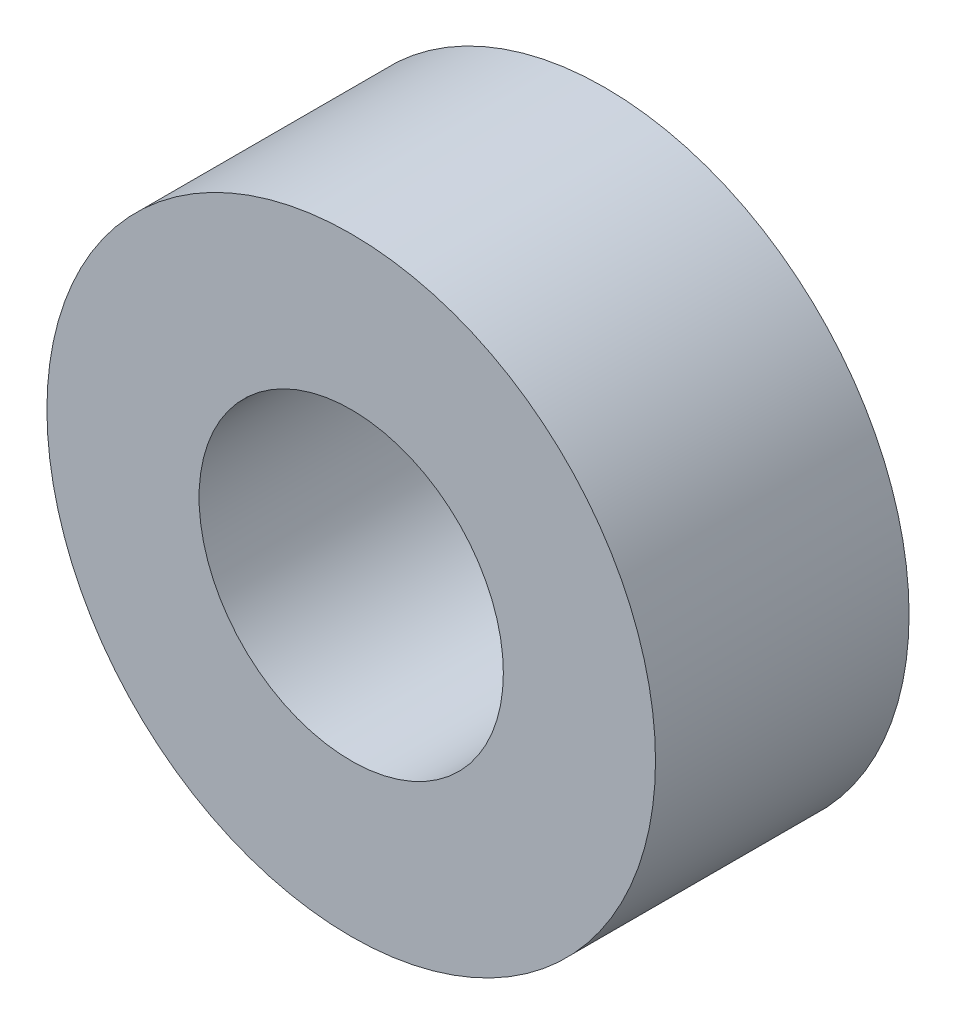
ISO-10303-21;
HEADER;
FILE_DESCRIPTION(('STEP AP214'),'2;1');
FILE_NAME('part.step','',(''),(''),'','','');
FILE_SCHEMA(('AUTOMOTIVE_DESIGN { 1 0 10303 214 1 1 1 1 }'));
ENDSEC;
DATA;
#1=APPLICATION_CONTEXT('core data for automotive mechanical design processes');
#2=APPLICATION_PROTOCOL_DEFINITION('international standard','automotive_design',2000,#1);
#3=PRODUCT_CONTEXT('',#1,'mechanical');
#4=PRODUCT('Part','Part','',(#3));
#5=PRODUCT_RELATED_PRODUCT_CATEGORY('part','',(#4));
#6=PRODUCT_DEFINITION_FORMATION('','',#4);
#7=PRODUCT_DEFINITION_CONTEXT('part definition',#1,'design');
#8=PRODUCT_DEFINITION('design','',#6,#7);
#9=PRODUCT_DEFINITION_SHAPE('','',#8);
#10=(LENGTH_UNIT() NAMED_UNIT(*) SI_UNIT(.MILLI.,.METRE.));
#11=(NAMED_UNIT(*) PLANE_ANGLE_UNIT() SI_UNIT($,.RADIAN.));
#12=(NAMED_UNIT(*) SI_UNIT($,.STERADIAN.) SOLID_ANGLE_UNIT());
#13=UNCERTAINTY_MEASURE_WITH_UNIT(LENGTH_MEASURE(1.E-05),#10,'distance_accuracy_value','');
#14=(GEOMETRIC_REPRESENTATION_CONTEXT(3) GLOBAL_UNCERTAINTY_ASSIGNED_CONTEXT((#13)) GLOBAL_UNIT_ASSIGNED_CONTEXT((#10,
#11,#12)) REPRESENTATION_CONTEXT('',''));
#15=CARTESIAN_POINT('',(0.,0.,0.));
#16=DIRECTION('',(0.,0.,1.));
#17=DIRECTION('',(1.,0.,0.));
#18=AXIS2_PLACEMENT_3D('',#15,#16,#17);
#19=CARTESIAN_POINT('',(0.,0.,2.5));
#20=DIRECTION('',(0.,0.,1.));
#21=DIRECTION('',(1.,0.,0.));
#22=AXIS2_PLACEMENT_3D('',#19,#20,#21);
#23=PLANE('',#22);
#24=CARTESIAN_POINT('',(0.,0.,2.5));
#25=DIRECTION('',(0.,0.,1.));
#26=DIRECTION('',(1.,0.,0.));
#27=AXIS2_PLACEMENT_3D('',#24,#25,#26);
#28=CIRCLE('',#27,3.);
#29=CARTESIAN_POINT('',(3.,0.,2.5));
#30=VERTEX_POINT('',#29);
#31=EDGE_CURVE('E10',#30,#30,#28,.T.);
#32=ORIENTED_EDGE('',*,*,#31,.T.);
#33=EDGE_LOOP('',(#32));
#34=FACE_BOUND('',#33,.T.);
#35=CARTESIAN_POINT('',(0.,0.,2.5));
#36=DIRECTION('',(0.,0.,1.));
#37=DIRECTION('',(1.,0.,0.));
#38=AXIS2_PLACEMENT_3D('',#35,#36,#37);
#39=CIRCLE('',#38,1.5);
#40=CARTESIAN_POINT('',(1.5,0.,2.5));
#41=VERTEX_POINT('',#40);
#42=EDGE_CURVE('E43',#41,#41,#39,.T.);
#43=ORIENTED_EDGE('',*,*,#42,.F.);
#44=EDGE_LOOP('',(#43));
#45=FACE_BOUND('',#44,.T.);
#46=ADVANCED_FACE('F32',(#34,#45),#23,.T.);
#47=CARTESIAN_POINT('',(0.,0.,0.));
#48=DIRECTION('',(0.,0.,1.));
#49=DIRECTION('',(1.,0.,0.));
#50=AXIS2_PLACEMENT_3D('',#47,#48,#49);
#51=PLANE('',#50);
#52=CARTESIAN_POINT('',(0.,0.,0.));
#53=DIRECTION('',(0.,0.,1.));
#54=DIRECTION('',(1.,0.,0.));
#55=AXIS2_PLACEMENT_3D('',#52,#53,#54);
#56=CIRCLE('',#55,3.);
#57=CARTESIAN_POINT('',(3.,0.,0.));
#58=VERTEX_POINT('',#57);
#59=EDGE_CURVE('E36',#58,#58,#56,.T.);
#60=ORIENTED_EDGE('',*,*,#59,.F.);
#61=EDGE_LOOP('',(#60));
#62=FACE_BOUND('',#61,.T.);
#63=CARTESIAN_POINT('',(0.,0.,0.));
#64=DIRECTION('',(0.,0.,1.));
#65=DIRECTION('',(1.,0.,0.));
#66=AXIS2_PLACEMENT_3D('',#63,#64,#65);
#67=CIRCLE('',#66,1.5);
#68=CARTESIAN_POINT('',(1.5,0.,0.));
#69=VERTEX_POINT('',#68);
#70=EDGE_CURVE('E45',#69,#69,#67,.T.);
#71=ORIENTED_EDGE('',*,*,#70,.T.);
#72=EDGE_LOOP('',(#71));
#73=FACE_BOUND('',#72,.T.);
#74=ADVANCED_FACE('F55',(#62,#73),#51,.F.);
#75=CARTESIAN_POINT('',(0.,0.,2.5));
#76=DIRECTION('',(0.,0.,-1.));
#77=DIRECTION('',(-1.,0.,0.));
#78=AXIS2_PLACEMENT_3D('',#75,#76,#77);
#79=CYLINDRICAL_SURFACE('',#78,3.);
#80=ORIENTED_EDGE('',*,*,#31,.F.);
#81=EDGE_LOOP('',(#80));
#82=FACE_BOUND('',#81,.T.);
#83=ORIENTED_EDGE('',*,*,#59,.T.);
#84=EDGE_LOOP('',(#83));
#85=FACE_BOUND('',#84,.T.);
#86=ADVANCED_FACE('F34',(#82,#85),#79,.T.);
#87=CARTESIAN_POINT('',(0.,0.,2.5));
#88=DIRECTION('',(0.,0.,-1.));
#89=DIRECTION('',(-1.,0.,0.));
#90=AXIS2_PLACEMENT_3D('',#87,#88,#89);
#91=CYLINDRICAL_SURFACE('',#90,1.5);
#92=ORIENTED_EDGE('',*,*,#42,.T.);
#93=EDGE_LOOP('',(#92));
#94=FACE_BOUND('',#93,.T.);
#95=ORIENTED_EDGE('',*,*,#70,.F.);
#96=EDGE_LOOP('',(#95));
#97=FACE_BOUND('',#96,.T.);
#98=ADVANCED_FACE('F51',(#94,#97),#91,.F.);
#99=CLOSED_SHELL('',(#46,#74,#86,#98));
#100=MANIFOLD_SOLID_BREP('B2',#99);
#101=ADVANCED_BREP_SHAPE_REPRESENTATION('',(#18,#100),#14);
#102=SHAPE_DEFINITION_REPRESENTATION(#9,#101);
ENDSEC;
END-ISO-10303-21;
